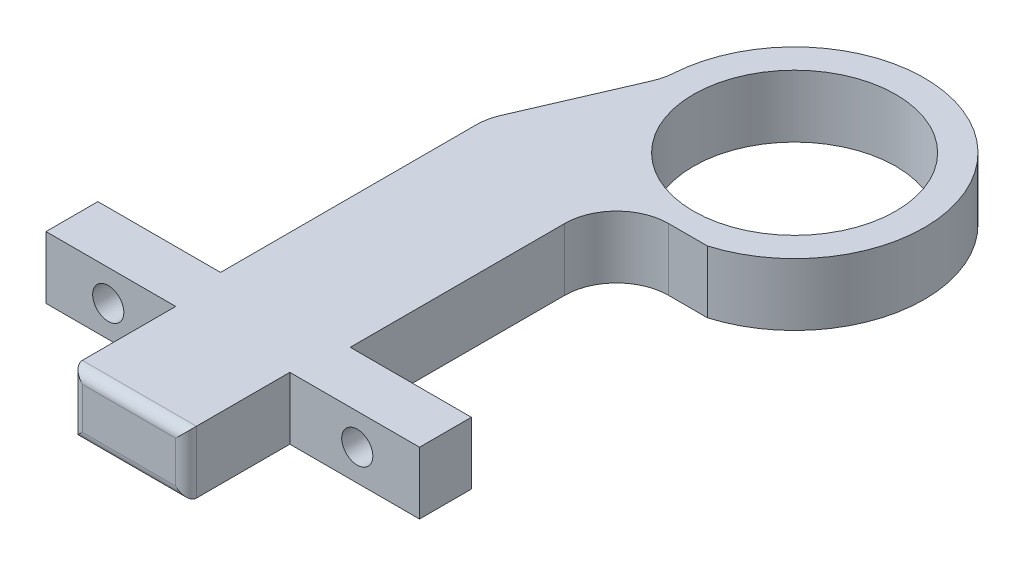
ISO-10303-21;
HEADER;
FILE_DESCRIPTION(('STEP AP214'),'2;1');
FILE_NAME('part.step','',(''),(''),'','','');
FILE_SCHEMA(('AUTOMOTIVE_DESIGN { 1 0 10303 214 1 1 1 1 }'));
ENDSEC;
DATA;
#1=APPLICATION_CONTEXT('core data for automotive mechanical design processes');
#2=APPLICATION_PROTOCOL_DEFINITION('international standard','automotive_design',2000,#1);
#3=PRODUCT_CONTEXT('',#1,'mechanical');
#4=PRODUCT('Part','Part','',(#3));
#5=PRODUCT_RELATED_PRODUCT_CATEGORY('part','',(#4));
#6=PRODUCT_DEFINITION_FORMATION('','',#4);
#7=PRODUCT_DEFINITION_CONTEXT('part definition',#1,'design');
#8=PRODUCT_DEFINITION('design','',#6,#7);
#9=PRODUCT_DEFINITION_SHAPE('','',#8);
#10=(LENGTH_UNIT() NAMED_UNIT(*) SI_UNIT(.MILLI.,.METRE.));
#11=(NAMED_UNIT(*) PLANE_ANGLE_UNIT() SI_UNIT($,.RADIAN.));
#12=(NAMED_UNIT(*) SI_UNIT($,.STERADIAN.) SOLID_ANGLE_UNIT());
#13=UNCERTAINTY_MEASURE_WITH_UNIT(LENGTH_MEASURE(1.E-05),#10,'distance_accuracy_value','');
#14=(GEOMETRIC_REPRESENTATION_CONTEXT(3) GLOBAL_UNCERTAINTY_ASSIGNED_CONTEXT((#13)) GLOBAL_UNIT_ASSIGNED_CONTEXT((#10,
#11,#12)) REPRESENTATION_CONTEXT('',''));
#15=CARTESIAN_POINT('',(0.,0.,0.));
#16=DIRECTION('',(0.,0.,1.));
#17=DIRECTION('',(1.,0.,0.));
#18=AXIS2_PLACEMENT_3D('',#15,#16,#17);
#19=CARTESIAN_POINT('',(0.,6.,16.));
#20=DIRECTION('',(0.,0.,1.));
#21=DIRECTION('',(1.,0.,0.));
#22=AXIS2_PLACEMENT_3D('',#19,#20,#21);
#23=PLANE('',#22);
#24=CARTESIAN_POINT('',(-12.,3.,16.));
#25=DIRECTION('',(0.,0.,1.));
#26=DIRECTION('',(1.,0.,0.));
#27=AXIS2_PLACEMENT_3D('',#24,#25,#26);
#28=CIRCLE('',#27,1.5);
#29=CARTESIAN_POINT('',(-10.5,3.,16.));
#30=VERTEX_POINT('',#29);
#31=EDGE_CURVE('E232',#30,#30,#28,.T.);
#32=ORIENTED_EDGE('',*,*,#31,.T.);
#33=EDGE_LOOP('',(#32));
#34=FACE_BOUND('',#33,.T.);
#35=DIRECTION('',(-1.,0.,0.));
#36=VECTOR('',#35,1.);
#37=CARTESIAN_POINT('',(0.,0.,16.));
#38=LINE('',#37,#36);
#39=CARTESIAN_POINT('',(-6.,0.,16.));
#40=VERTEX_POINT('',#39);
#41=CARTESIAN_POINT('',(-17.6776695296638,0.,16.));
#42=VERTEX_POINT('',#41);
#43=EDGE_CURVE('E192',#40,#42,#38,.T.);
#44=ORIENTED_EDGE('',*,*,#43,.T.);
#45=DIRECTION('',(0.,-1.,0.));
#46=VECTOR('',#45,1.);
#47=CARTESIAN_POINT('',(-17.6776695296638,6.,16.));
#48=LINE('',#47,#46);
#49=CARTESIAN_POINT('',(-17.6776695296638,6.,16.));
#50=VERTEX_POINT('',#49);
#51=EDGE_CURVE('E173',#50,#42,#48,.T.);
#52=ORIENTED_EDGE('',*,*,#51,.F.);
#53=DIRECTION('',(-1.,0.,0.));
#54=VECTOR('',#53,1.);
#55=CARTESIAN_POINT('',(0.,6.,16.));
#56=LINE('',#55,#54);
#57=CARTESIAN_POINT('',(-6.,6.,16.));
#58=VERTEX_POINT('',#57);
#59=EDGE_CURVE('E179',#58,#50,#56,.T.);
#60=ORIENTED_EDGE('',*,*,#59,.F.);
#61=DIRECTION('',(0.,-1.,0.));
#62=VECTOR('',#61,1.);
#63=CARTESIAN_POINT('',(-6.,6.,16.));
#64=LINE('',#63,#62);
#65=EDGE_CURVE('E270',#58,#40,#64,.T.);
#66=ORIENTED_EDGE('',*,*,#65,.T.);
#67=EDGE_LOOP('',(#44,#52,#60,#66));
#68=FACE_BOUND('',#67,.T.);
#69=ADVANCED_FACE('F35',(#34,#68),#23,.F.);
#70=CARTESIAN_POINT('',(-17.6776695296638,6.,0.));
#71=DIRECTION('',(-1.,0.,0.));
#72=DIRECTION('',(0.,0.,1.));
#73=AXIS2_PLACEMENT_3D('',#70,#71,#72);
#74=PLANE('',#73);
#75=DIRECTION('',(0.,0.,-1.));
#76=VECTOR('',#75,1.);
#77=CARTESIAN_POINT('',(-17.6776695296638,0.,0.));
#78=LINE('',#77,#76);
#79=CARTESIAN_POINT('',(-17.6776695296638,0.,-4.67169950086209));
#80=VERTEX_POINT('',#79);
#81=EDGE_CURVE('E272',#42,#80,#78,.T.);
#82=ORIENTED_EDGE('',*,*,#81,.T.);
#83=DIRECTION('',(0.,-1.,0.));
#84=VECTOR('',#83,1.);
#85=CARTESIAN_POINT('',(-17.6776695296638,6.,-4.67169950086209));
#86=LINE('',#85,#84);
#87=CARTESIAN_POINT('',(-17.6776695296638,6.,-4.67169950086209));
#88=VERTEX_POINT('',#87);
#89=EDGE_CURVE('E176',#88,#80,#86,.T.);
#90=ORIENTED_EDGE('',*,*,#89,.F.);
#91=DIRECTION('',(0.,0.,-1.));
#92=VECTOR('',#91,1.);
#93=CARTESIAN_POINT('',(-17.6776695296638,6.,0.));
#94=LINE('',#93,#92);
#95=EDGE_CURVE('E169',#50,#88,#94,.T.);
#96=ORIENTED_EDGE('',*,*,#95,.F.);
#97=ORIENTED_EDGE('',*,*,#51,.T.);
#98=EDGE_LOOP('',(#82,#90,#96,#97));
#99=FACE_BOUND('',#98,.T.);
#100=ADVANCED_FACE('F171',(#99),#74,.F.);
#101=CARTESIAN_POINT('',(-12.6776695296638,6.,-4.67169950086212));
#102=DIRECTION('',(0.,-1.,0.));
#103=DIRECTION('',(0.,0.,-1.));
#104=AXIS2_PLACEMENT_3D('',#101,#102,#103);
#105=CYLINDRICAL_SURFACE('',#104,5.);
#106=CARTESIAN_POINT('',(-12.6776695296638,0.,-4.67169950086212));
#107=DIRECTION('',(0.,1.,0.));
#108=DIRECTION('',(0.,0.,1.));
#109=AXIS2_PLACEMENT_3D('',#106,#107,#108);
#110=CIRCLE('',#109,5.);
#111=CARTESIAN_POINT('',(-12.6776695296638,0.,-9.67169950086212));
#112=VERTEX_POINT('',#111);
#113=EDGE_CURVE('E275',#80,#112,#110,.F.);
#114=ORIENTED_EDGE('',*,*,#113,.T.);
#115=DIRECTION('',(0.,-1.,0.));
#116=VECTOR('',#115,1.);
#117=CARTESIAN_POINT('',(-12.6776695296638,6.,-9.67169950086212));
#118=LINE('',#117,#116);
#119=CARTESIAN_POINT('',(-12.6776695296638,6.,-9.67169950086212));
#120=VERTEX_POINT('',#119);
#121=EDGE_CURVE('E197',#120,#112,#118,.T.);
#122=ORIENTED_EDGE('',*,*,#121,.F.);
#123=CARTESIAN_POINT('',(-12.6776695296638,6.,-4.67169950086212));
#124=DIRECTION('',(0.,1.,0.));
#125=DIRECTION('',(0.,0.,1.));
#126=AXIS2_PLACEMENT_3D('',#123,#124,#125);
#127=CIRCLE('',#126,5.);
#128=EDGE_CURVE('E178',#88,#120,#127,.F.);
#129=ORIENTED_EDGE('',*,*,#128,.F.);
#130=ORIENTED_EDGE('',*,*,#89,.T.);
#131=EDGE_LOOP('',(#114,#122,#129,#130));
#132=FACE_BOUND('',#131,.T.);
#133=ADVANCED_FACE('F343',(#132),#105,.F.);
#134=CARTESIAN_POINT('',(0.,6.,-9.67169950086212));
#135=DIRECTION('',(0.,0.,1.));
#136=DIRECTION('',(1.,0.,0.));
#137=AXIS2_PLACEMENT_3D('',#134,#135,#136);
#138=PLANE('',#137);
#139=DIRECTION('',(-1.,0.,0.));
#140=VECTOR('',#139,1.);
#141=CARTESIAN_POINT('',(0.,0.,-9.67169950086212));
#142=LINE('',#141,#140);
#143=CARTESIAN_POINT('',(-8.92857142857138,0.,-9.67169950086212));
#144=VERTEX_POINT('',#143);
#145=EDGE_CURVE('E278',#144,#112,#142,.T.);
#146=ORIENTED_EDGE('',*,*,#145,.F.);
#147=DIRECTION('',(0.,-1.,0.));
#148=VECTOR('',#147,1.);
#149=CARTESIAN_POINT('',(-8.92857142857138,6.,-9.67169950086212));
#150=LINE('',#149,#148);
#151=CARTESIAN_POINT('',(-8.92857142857138,6.,-9.67169950086212));
#152=VERTEX_POINT('',#151);
#153=EDGE_CURVE('E335',#152,#144,#150,.T.);
#154=ORIENTED_EDGE('',*,*,#153,.F.);
#155=DIRECTION('',(-1.,0.,0.));
#156=VECTOR('',#155,1.);
#157=CARTESIAN_POINT('',(0.,6.,-9.67169950086212));
#158=LINE('',#157,#156);
#159=EDGE_CURVE('E241',#152,#120,#158,.T.);
#160=ORIENTED_EDGE('',*,*,#159,.T.);
#161=ORIENTED_EDGE('',*,*,#121,.T.);
#162=EDGE_LOOP('',(#146,#154,#160,#161));
#163=FACE_BOUND('',#162,.T.);
#164=ADVANCED_FACE('F339',(#163),#138,.T.);
#165=CARTESIAN_POINT('',(-12.5,6.,-21.650635094611));
#166=DIRECTION('',(0.,-1.,0.));
#167=DIRECTION('',(0.,0.,-1.));
#168=AXIS2_PLACEMENT_3D('',#165,#166,#167);
#169=CYLINDRICAL_SURFACE('',#168,12.5);
#170=CARTESIAN_POINT('',(-12.5,0.,-21.650635094611));
#171=DIRECTION('',(0.,1.,0.));
#172=DIRECTION('',(0.,0.,1.));
#173=AXIS2_PLACEMENT_3D('',#170,#171,#172);
#174=CIRCLE('',#173,12.5);
#175=CARTESIAN_POINT('',(-24.9745166094324,0.,-22.4484040843536));
#176=VERTEX_POINT('',#175);
#177=EDGE_CURVE('E281',#144,#176,#174,.T.);
#178=ORIENTED_EDGE('',*,*,#177,.T.);
#179=DIRECTION('',(0.,-1.,0.));
#180=VECTOR('',#179,1.);
#181=CARTESIAN_POINT('',(-24.9745166094324,6.,-22.4484040843536));
#182=LINE('',#181,#180);
#183=CARTESIAN_POINT('',(-24.9745166094324,6.,-22.4484040843536));
#184=VERTEX_POINT('',#183);
#185=EDGE_CURVE('E332',#184,#176,#182,.T.);
#186=ORIENTED_EDGE('',*,*,#185,.F.);
#187=CARTESIAN_POINT('',(-12.5,6.,-21.650635094611));
#188=DIRECTION('',(0.,1.,0.));
#189=DIRECTION('',(0.,0.,1.));
#190=AXIS2_PLACEMENT_3D('',#187,#188,#189);
#191=CIRCLE('',#190,12.5);
#192=EDGE_CURVE('E244',#152,#184,#191,.T.);
#193=ORIENTED_EDGE('',*,*,#192,.F.);
#194=ORIENTED_EDGE('',*,*,#153,.T.);
#195=EDGE_LOOP('',(#178,#186,#193,#194));
#196=FACE_BOUND('',#195,.T.);
#197=ADVANCED_FACE('F351',(#196),#169,.T.);
#198=CARTESIAN_POINT('',(-29.9643232532053,6.,-22.7675116802506));
#199=DIRECTION('',(0.,-1.,0.));
#200=DIRECTION('',(0.,0.,-1.));
#201=AXIS2_PLACEMENT_3D('',#198,#199,#200);
#202=CYLINDRICAL_SURFACE('',#201,5.);
#203=CARTESIAN_POINT('',(-29.9643232532053,0.,-22.7675116802506));
#204=DIRECTION('',(0.,1.,0.));
#205=DIRECTION('',(0.,0.,1.));
#206=AXIS2_PLACEMENT_3D('',#203,#204,#205);
#207=CIRCLE('',#206,5.);
#208=CARTESIAN_POINT('',(-25.3747016471425,0.,-20.7837340936344));
#209=VERTEX_POINT('',#208);
#210=EDGE_CURVE('E283',#176,#209,#207,.F.);
#211=ORIENTED_EDGE('',*,*,#210,.T.);
#212=DIRECTION('',(0.,-1.,0.));
#213=VECTOR('',#212,1.);
#214=CARTESIAN_POINT('',(-25.3747016471425,6.,-20.7837340936344));
#215=LINE('',#214,#213);
#216=CARTESIAN_POINT('',(-25.3747016471425,6.,-20.7837340936344));
#217=VERTEX_POINT('',#216);
#218=EDGE_CURVE('E330',#217,#209,#215,.T.);
#219=ORIENTED_EDGE('',*,*,#218,.F.);
#220=CARTESIAN_POINT('',(-29.9643232532053,6.,-22.7675116802506));
#221=DIRECTION('',(0.,1.,0.));
#222=DIRECTION('',(0.,0.,1.));
#223=AXIS2_PLACEMENT_3D('',#220,#221,#222);
#224=CIRCLE('',#223,5.);
#225=EDGE_CURVE('E246',#184,#217,#224,.F.);
#226=ORIENTED_EDGE('',*,*,#225,.F.);
#227=ORIENTED_EDGE('',*,*,#185,.T.);
#228=EDGE_LOOP('',(#211,#219,#226,#227));
#229=FACE_BOUND('',#228,.T.);
#230=ADVANCED_FACE('F355',(#229),#202,.F.);
#231=CARTESIAN_POINT('',(-28.9496046006768,6.,-12.5129219089349));
#232=DIRECTION('',(-0.917924321212573,0.,-0.396755517323247));
#233=DIRECTION('',(-0.396755517323247,0.,0.917924321212573));
#234=AXIS2_PLACEMENT_3D('',#231,#232,#233);
#235=PLANE('',#234);
#236=DIRECTION('',(0.396755517323247,0.,-0.917924321212573));
#237=VECTOR('',#236,1.);
#238=CARTESIAN_POINT('',(-28.9496046006768,0.,-12.5129219089349));
#239=LINE('',#238,#237);
#240=CARTESIAN_POINT('',(-29.7672911357266,0.,-10.6211413920209));
#241=VERTEX_POINT('',#240);
#242=EDGE_CURVE('E286',#241,#209,#239,.T.);
#243=ORIENTED_EDGE('',*,*,#242,.F.);
#244=DIRECTION('',(0.,-1.,0.));
#245=VECTOR('',#244,1.);
#246=CARTESIAN_POINT('',(-29.7672911357266,6.,-10.6211413920209));
#247=LINE('',#246,#245);
#248=CARTESIAN_POINT('',(-29.7672911357266,6.,-10.6211413920209));
#249=VERTEX_POINT('',#248);
#250=EDGE_CURVE('E328',#249,#241,#247,.T.);
#251=ORIENTED_EDGE('',*,*,#250,.F.);
#252=DIRECTION('',(0.396755517323247,0.,-0.917924321212573));
#253=VECTOR('',#252,1.);
#254=CARTESIAN_POINT('',(-28.9496046006768,6.,-12.5129219089349));
#255=LINE('',#254,#253);
#256=EDGE_CURVE('E248',#249,#217,#255,.T.);
#257=ORIENTED_EDGE('',*,*,#256,.T.);
#258=ORIENTED_EDGE('',*,*,#218,.T.);
#259=EDGE_LOOP('',(#243,#251,#257,#258));
#260=FACE_BOUND('',#259,.T.);
#261=ADVANCED_FACE('F515',(#260),#235,.T.);
#262=CARTESIAN_POINT('',(-25.1776695296638,6.,-8.63736380540464));
#263=DIRECTION('',(0.,-1.,0.));
#264=DIRECTION('',(0.,0.,-1.));
#265=AXIS2_PLACEMENT_3D('',#262,#263,#264);
#266=CYLINDRICAL_SURFACE('',#265,5.);
#267=CARTESIAN_POINT('',(-25.1776695296638,0.,-8.63736380540464));
#268=DIRECTION('',(0.,1.,0.));
#269=DIRECTION('',(0.,0.,1.));
#270=AXIS2_PLACEMENT_3D('',#267,#268,#269);
#271=CIRCLE('',#270,5.);
#272=CARTESIAN_POINT('',(-30.1776695296638,0.,-8.63736380540462));
#273=VERTEX_POINT('',#272);
#274=EDGE_CURVE('E289',#273,#241,#271,.F.);
#275=ORIENTED_EDGE('',*,*,#274,.F.);
#276=DIRECTION('',(0.,-1.,0.));
#277=VECTOR('',#276,1.);
#278=CARTESIAN_POINT('',(-30.1776695296638,6.,-8.63736380540462));
#279=LINE('',#278,#277);
#280=CARTESIAN_POINT('',(-30.1776695296638,6.,-8.63736380540462));
#281=VERTEX_POINT('',#280);
#282=EDGE_CURVE('E326',#281,#273,#279,.T.);
#283=ORIENTED_EDGE('',*,*,#282,.F.);
#284=CARTESIAN_POINT('',(-25.1776695296638,6.,-8.63736380540464));
#285=DIRECTION('',(0.,1.,0.));
#286=DIRECTION('',(0.,0.,1.));
#287=AXIS2_PLACEMENT_3D('',#284,#285,#286);
#288=CIRCLE('',#287,5.);
#289=EDGE_CURVE('E251',#281,#249,#288,.F.);
#290=ORIENTED_EDGE('',*,*,#289,.T.);
#291=ORIENTED_EDGE('',*,*,#250,.T.);
#292=EDGE_LOOP('',(#275,#283,#290,#291));
#293=FACE_BOUND('',#292,.T.);
#294=ADVANCED_FACE('F363',(#293),#266,.T.);
#295=CARTESIAN_POINT('',(-30.1776695296638,6.,0.));
#296=DIRECTION('',(-1.,0.,0.));
#297=DIRECTION('',(0.,0.,1.));
#298=AXIS2_PLACEMENT_3D('',#295,#296,#297);
#299=PLANE('',#298);
#300=DIRECTION('',(0.,0.,-1.));
#301=VECTOR('',#300,1.);
#302=CARTESIAN_POINT('',(-30.1776695296638,0.,0.));
#303=LINE('',#302,#301);
#304=CARTESIAN_POINT('',(-30.1776695296638,0.,16.));
#305=VERTEX_POINT('',#304);
#306=EDGE_CURVE('E292',#305,#273,#303,.T.);
#307=ORIENTED_EDGE('',*,*,#306,.F.);
#308=DIRECTION('',(0.,-1.,0.));
#309=VECTOR('',#308,1.);
#310=CARTESIAN_POINT('',(-30.1776695296638,6.,16.));
#311=LINE('',#310,#309);
#312=CARTESIAN_POINT('',(-30.1776695296638,6.,16.));
#313=VERTEX_POINT('',#312);
#314=EDGE_CURVE('E324',#313,#305,#311,.T.);
#315=ORIENTED_EDGE('',*,*,#314,.F.);
#316=DIRECTION('',(0.,0.,-1.));
#317=VECTOR('',#316,1.);
#318=CARTESIAN_POINT('',(-30.1776695296638,6.,0.));
#319=LINE('',#318,#317);
#320=EDGE_CURVE('E254',#313,#281,#319,.T.);
#321=ORIENTED_EDGE('',*,*,#320,.T.);
#322=ORIENTED_EDGE('',*,*,#282,.T.);
#323=EDGE_LOOP('',(#307,#315,#321,#322));
#324=FACE_BOUND('',#323,.T.);
#325=ADVANCED_FACE('F367',(#324),#299,.T.);
#326=CARTESIAN_POINT('',(-36.,3.,16.));
#327=DIRECTION('',(0.,0.,1.));
#328=DIRECTION('',(1.,0.,0.));
#329=AXIS2_PLACEMENT_3D('',#326,#327,#328);
#330=CIRCLE('',#329,1.5);
#331=CARTESIAN_POINT('',(-34.5,3.,16.));
#332=VERTEX_POINT('',#331);
#333=EDGE_CURVE('E237',#332,#332,#330,.T.);
#334=ORIENTED_EDGE('',*,*,#333,.T.);
#335=EDGE_LOOP('',(#334));
#336=FACE_BOUND('',#335,.T.);
#337=CARTESIAN_POINT('',(-42.,0.,16.));
#338=VERTEX_POINT('',#337);
#339=EDGE_CURVE('E273',#305,#338,#38,.T.);
#340=ORIENTED_EDGE('',*,*,#339,.T.);
#341=DIRECTION('',(0.,-1.,0.));
#342=VECTOR('',#341,1.);
#343=CARTESIAN_POINT('',(-42.,6.,16.));
#344=LINE('',#343,#342);
#345=CARTESIAN_POINT('',(-42.,6.,16.));
#346=VERTEX_POINT('',#345);
#347=EDGE_CURVE('E321',#346,#338,#344,.T.);
#348=ORIENTED_EDGE('',*,*,#347,.F.);
#349=EDGE_CURVE('E190',#313,#346,#56,.T.);
#350=ORIENTED_EDGE('',*,*,#349,.F.);
#351=ORIENTED_EDGE('',*,*,#314,.T.);
#352=EDGE_LOOP('',(#340,#348,#350,#351));
#353=FACE_BOUND('',#352,.T.);
#354=ADVANCED_FACE('F373',(#336,#353),#23,.F.);
#355=CARTESIAN_POINT('',(-42.,6.,0.));
#356=DIRECTION('',(1.,0.,0.));
#357=DIRECTION('',(0.,0.,-1.));
#358=AXIS2_PLACEMENT_3D('',#355,#356,#357);
#359=PLANE('',#358);
#360=DIRECTION('',(0.,0.,1.));
#361=VECTOR('',#360,1.);
#362=CARTESIAN_POINT('',(-42.,0.,0.));
#363=LINE('',#362,#361);
#364=CARTESIAN_POINT('',(-42.,0.,21.));
#365=VERTEX_POINT('',#364);
#366=EDGE_CURVE('E295',#338,#365,#363,.T.);
#367=ORIENTED_EDGE('',*,*,#366,.T.);
#368=DIRECTION('',(0.,-1.,0.));
#369=VECTOR('',#368,1.);
#370=CARTESIAN_POINT('',(-42.,6.,21.));
#371=LINE('',#370,#369);
#372=CARTESIAN_POINT('',(-42.,6.,21.));
#373=VERTEX_POINT('',#372);
#374=EDGE_CURVE('E318',#373,#365,#371,.T.);
#375=ORIENTED_EDGE('',*,*,#374,.F.);
#376=DIRECTION('',(0.,0.,1.));
#377=VECTOR('',#376,1.);
#378=CARTESIAN_POINT('',(-42.,6.,0.));
#379=LINE('',#378,#377);
#380=EDGE_CURVE('E257',#346,#373,#379,.T.);
#381=ORIENTED_EDGE('',*,*,#380,.F.);
#382=ORIENTED_EDGE('',*,*,#347,.T.);
#383=EDGE_LOOP('',(#367,#375,#381,#382));
#384=FACE_BOUND('',#383,.T.);
#385=ADVANCED_FACE('F377',(#384),#359,.F.);
#386=CARTESIAN_POINT('',(0.,6.,21.));
#387=DIRECTION('',(0.,0.,-1.));
#388=DIRECTION('',(-1.,0.,0.));
#389=AXIS2_PLACEMENT_3D('',#386,#387,#388);
#390=PLANE('',#389);
#391=CARTESIAN_POINT('',(-36.,3.,21.));
#392=DIRECTION('',(0.,0.,1.));
#393=DIRECTION('',(1.,0.,0.));
#394=AXIS2_PLACEMENT_3D('',#391,#392,#393);
#395=CIRCLE('',#394,1.5);
#396=CARTESIAN_POINT('',(-34.5,3.,21.));
#397=VERTEX_POINT('',#396);
#398=EDGE_CURVE('E227',#397,#397,#395,.T.);
#399=ORIENTED_EDGE('',*,*,#398,.F.);
#400=EDGE_LOOP('',(#399));
#401=FACE_BOUND('',#400,.T.);
#402=DIRECTION('',(1.,0.,0.));
#403=VECTOR('',#402,1.);
#404=CARTESIAN_POINT('',(0.,0.,21.));
#405=LINE('',#404,#403);
#406=CARTESIAN_POINT('',(-29.5,0.,21.));
#407=VERTEX_POINT('',#406);
#408=EDGE_CURVE('E297',#365,#407,#405,.T.);
#409=ORIENTED_EDGE('',*,*,#408,.T.);
#410=DIRECTION('',(0.,-1.,0.));
#411=VECTOR('',#410,1.);
#412=CARTESIAN_POINT('',(-29.5,6.,21.));
#413=LINE('',#412,#411);
#414=CARTESIAN_POINT('',(-29.5,6.,21.));
#415=VERTEX_POINT('',#414);
#416=EDGE_CURVE('E315',#415,#407,#413,.T.);
#417=ORIENTED_EDGE('',*,*,#416,.F.);
#418=DIRECTION('',(1.,0.,0.));
#419=VECTOR('',#418,1.);
#420=CARTESIAN_POINT('',(0.,6.,21.));
#421=LINE('',#420,#419);
#422=EDGE_CURVE('E259',#373,#415,#421,.T.);
#423=ORIENTED_EDGE('',*,*,#422,.F.);
#424=ORIENTED_EDGE('',*,*,#374,.T.);
#425=EDGE_LOOP('',(#409,#417,#423,#424));
#426=FACE_BOUND('',#425,.T.);
#427=ADVANCED_FACE('F382',(#401,#426),#390,.F.);
#428=CARTESIAN_POINT('',(-29.5,6.,0.));
#429=DIRECTION('',(1.,0.,0.));
#430=DIRECTION('',(0.,0.,-1.));
#431=AXIS2_PLACEMENT_3D('',#428,#429,#430);
#432=PLANE('',#431);
#433=DIRECTION('',(0.,0.,1.));
#434=VECTOR('',#433,1.);
#435=CARTESIAN_POINT('',(-29.5,0.,0.));
#436=LINE('',#435,#434);
#437=CARTESIAN_POINT('',(-29.5,0.,30.));
#438=VERTEX_POINT('',#437);
#439=EDGE_CURVE('E299',#407,#438,#436,.T.);
#440=ORIENTED_EDGE('',*,*,#439,.T.);
#441=DIRECTION('',(0.,-1.,0.));
#442=VECTOR('',#441,1.);
#443=CARTESIAN_POINT('',(-29.5,6.,30.));
#444=LINE('',#443,#442);
#445=CARTESIAN_POINT('',(-29.5,6.,30.));
#446=VERTEX_POINT('',#445);
#447=EDGE_CURVE('E207',#438,#446,#444,.F.);
#448=ORIENTED_EDGE('',*,*,#447,.T.);
#449=DIRECTION('',(0.,0.,1.));
#450=VECTOR('',#449,1.);
#451=CARTESIAN_POINT('',(-29.5,6.,0.));
#452=LINE('',#451,#450);
#453=EDGE_CURVE('E261',#415,#446,#452,.T.);
#454=ORIENTED_EDGE('',*,*,#453,.F.);
#455=ORIENTED_EDGE('',*,*,#416,.T.);
#456=EDGE_LOOP('',(#440,#448,#454,#455));
#457=FACE_BOUND('',#456,.T.);
#458=ADVANCED_FACE('F385',(#457),#432,.F.);
#459=CARTESIAN_POINT('',(0.,6.,31.));
#460=DIRECTION('',(0.,0.,-1.));
#461=DIRECTION('',(-1.,0.,0.));
#462=AXIS2_PLACEMENT_3D('',#459,#460,#461);
#463=PLANE('',#462);
#464=DIRECTION('',(1.,0.,0.));
#465=VECTOR('',#464,1.);
#466=CARTESIAN_POINT('',(-29.5,5.,31.));
#467=LINE('',#466,#465);
#468=CARTESIAN_POINT('',(-19.5,5.,31.));
#469=VERTEX_POINT('',#468);
#470=CARTESIAN_POINT('',(-28.5,5.,31.));
#471=VERTEX_POINT('',#470);
#472=EDGE_CURVE('E202',#469,#471,#467,.F.);
#473=ORIENTED_EDGE('',*,*,#472,.T.);
#474=DIRECTION('',(0.,-1.,0.));
#475=VECTOR('',#474,1.);
#476=CARTESIAN_POINT('',(-28.5,6.,31.));
#477=LINE('',#476,#475);
#478=CARTESIAN_POINT('',(-28.5,1.,31.));
#479=VERTEX_POINT('',#478);
#480=EDGE_CURVE('E204',#471,#479,#477,.T.);
#481=ORIENTED_EDGE('',*,*,#480,.T.);
#482=DIRECTION('',(1.,0.,0.));
#483=VECTOR('',#482,1.);
#484=CARTESIAN_POINT('',(0.,1.,31.));
#485=LINE('',#484,#483);
#486=CARTESIAN_POINT('',(-19.5,1.,31.));
#487=VERTEX_POINT('',#486);
#488=EDGE_CURVE('E193',#479,#487,#485,.T.);
#489=ORIENTED_EDGE('',*,*,#488,.T.);
#490=DIRECTION('',(0.,-1.,0.));
#491=VECTOR('',#490,1.);
#492=CARTESIAN_POINT('',(-19.5,6.,31.));
#493=LINE('',#492,#491);
#494=EDGE_CURVE('E195',#487,#469,#493,.F.);
#495=ORIENTED_EDGE('',*,*,#494,.T.);
#496=EDGE_LOOP('',(#473,#481,#489,#495));
#497=FACE_BOUND('',#496,.T.);
#498=ADVANCED_FACE('F396',(#497),#463,.F.);
#499=CARTESIAN_POINT('',(-18.5,6.,0.));
#500=DIRECTION('',(1.,0.,0.));
#501=DIRECTION('',(0.,0.,-1.));
#502=AXIS2_PLACEMENT_3D('',#499,#500,#501);
#503=PLANE('',#502);
#504=DIRECTION('',(0.,0.,1.));
#505=VECTOR('',#504,1.);
#506=CARTESIAN_POINT('',(-18.5,6.,0.));
#507=LINE('',#506,#505);
#508=CARTESIAN_POINT('',(-18.5,6.,21.));
#509=VERTEX_POINT('',#508);
#510=CARTESIAN_POINT('',(-18.5,6.,30.));
#511=VERTEX_POINT('',#510);
#512=EDGE_CURVE('E264',#509,#511,#507,.T.);
#513=ORIENTED_EDGE('',*,*,#512,.T.);
#514=DIRECTION('',(0.,-1.,0.));
#515=VECTOR('',#514,1.);
#516=CARTESIAN_POINT('',(-18.5,0.,30.));
#517=LINE('',#516,#515);
#518=CARTESIAN_POINT('',(-18.5,0.,30.));
#519=VERTEX_POINT('',#518);
#520=EDGE_CURVE('E44',#511,#519,#517,.T.);
#521=ORIENTED_EDGE('',*,*,#520,.T.);
#522=DIRECTION('',(0.,0.,1.));
#523=VECTOR('',#522,1.);
#524=CARTESIAN_POINT('',(-18.5,0.,0.));
#525=LINE('',#524,#523);
#526=CARTESIAN_POINT('',(-18.5,0.,21.));
#527=VERTEX_POINT('',#526);
#528=EDGE_CURVE('E303',#527,#519,#525,.T.);
#529=ORIENTED_EDGE('',*,*,#528,.F.);
#530=DIRECTION('',(0.,-1.,0.));
#531=VECTOR('',#530,1.);
#532=CARTESIAN_POINT('',(-18.5,6.,21.));
#533=LINE('',#532,#531);
#534=EDGE_CURVE('E313',#509,#527,#533,.T.);
#535=ORIENTED_EDGE('',*,*,#534,.F.);
#536=EDGE_LOOP('',(#513,#521,#529,#535));
#537=FACE_BOUND('',#536,.T.);
#538=ADVANCED_FACE('F447',(#537),#503,.T.);
#539=CARTESIAN_POINT('',(-12.,3.,21.));
#540=DIRECTION('',(0.,0.,1.));
#541=DIRECTION('',(1.,0.,0.));
#542=AXIS2_PLACEMENT_3D('',#539,#540,#541);
#543=CIRCLE('',#542,1.5);
#544=CARTESIAN_POINT('',(-10.5,3.,21.));
#545=VERTEX_POINT('',#544);
#546=EDGE_CURVE('E222',#545,#545,#543,.T.);
#547=ORIENTED_EDGE('',*,*,#546,.F.);
#548=EDGE_LOOP('',(#547));
#549=FACE_BOUND('',#548,.T.);
#550=CARTESIAN_POINT('',(-6.,0.,21.));
#551=VERTEX_POINT('',#550);
#552=EDGE_CURVE('E300',#527,#551,#405,.T.);
#553=ORIENTED_EDGE('',*,*,#552,.T.);
#554=DIRECTION('',(0.,-1.,0.));
#555=VECTOR('',#554,1.);
#556=CARTESIAN_POINT('',(-6.,6.,21.));
#557=LINE('',#556,#555);
#558=CARTESIAN_POINT('',(-6.,6.,21.));
#559=VERTEX_POINT('',#558);
#560=EDGE_CURVE('E311',#559,#551,#557,.T.);
#561=ORIENTED_EDGE('',*,*,#560,.F.);
#562=EDGE_CURVE('E262',#509,#559,#421,.T.);
#563=ORIENTED_EDGE('',*,*,#562,.F.);
#564=ORIENTED_EDGE('',*,*,#534,.T.);
#565=EDGE_LOOP('',(#553,#561,#563,#564));
#566=FACE_BOUND('',#565,.T.);
#567=ADVANCED_FACE('F443',(#549,#566),#390,.F.);
#568=CARTESIAN_POINT('',(-6.,6.,0.));
#569=DIRECTION('',(1.,0.,0.));
#570=DIRECTION('',(0.,0.,-1.));
#571=AXIS2_PLACEMENT_3D('',#568,#569,#570);
#572=PLANE('',#571);
#573=DIRECTION('',(0.,0.,1.));
#574=VECTOR('',#573,1.);
#575=CARTESIAN_POINT('',(-6.,0.,0.));
#576=LINE('',#575,#574);
#577=EDGE_CURVE('E305',#40,#551,#576,.T.);
#578=ORIENTED_EDGE('',*,*,#577,.F.);
#579=ORIENTED_EDGE('',*,*,#65,.F.);
#580=DIRECTION('',(0.,0.,1.));
#581=VECTOR('',#580,1.);
#582=CARTESIAN_POINT('',(-6.,6.,0.));
#583=LINE('',#582,#581);
#584=EDGE_CURVE('E186',#58,#559,#583,.T.);
#585=ORIENTED_EDGE('',*,*,#584,.T.);
#586=ORIENTED_EDGE('',*,*,#560,.T.);
#587=EDGE_LOOP('',(#578,#579,#585,#586));
#588=FACE_BOUND('',#587,.T.);
#589=ADVANCED_FACE('F439',(#588),#572,.T.);
#590=CARTESIAN_POINT('',(-12.5,6.,-21.650635094611));
#591=DIRECTION('',(0.,-1.,0.));
#592=DIRECTION('',(0.,0.,-1.));
#593=AXIS2_PLACEMENT_3D('',#590,#591,#592);
#594=CYLINDRICAL_SURFACE('',#593,9.75);
#595=CARTESIAN_POINT('',(-12.5,6.,-21.650635094611));
#596=DIRECTION('',(0.,1.,0.));
#597=DIRECTION('',(0.,0.,1.));
#598=AXIS2_PLACEMENT_3D('',#595,#596,#597);
#599=CIRCLE('',#598,9.75);
#600=CARTESIAN_POINT('',(-12.5,6.,-11.900635094611));
#601=VERTEX_POINT('',#600);
#602=EDGE_CURVE('E267',#601,#601,#599,.T.);
#603=ORIENTED_EDGE('',*,*,#602,.T.);
#604=EDGE_LOOP('',(#603));
#605=FACE_BOUND('',#604,.T.);
#606=CARTESIAN_POINT('',(-12.5,0.,-21.650635094611));
#607=DIRECTION('',(0.,1.,0.));
#608=DIRECTION('',(0.,0.,1.));
#609=AXIS2_PLACEMENT_3D('',#606,#607,#608);
#610=CIRCLE('',#609,9.75);
#611=CARTESIAN_POINT('',(-12.5,0.,-11.900635094611));
#612=VERTEX_POINT('',#611);
#613=EDGE_CURVE('E188',#612,#612,#610,.T.);
#614=ORIENTED_EDGE('',*,*,#613,.F.);
#615=EDGE_LOOP('',(#614));
#616=FACE_BOUND('',#615,.T.);
#617=ADVANCED_FACE('F434',(#605,#616),#594,.F.);
#618=CARTESIAN_POINT('',(0.,6.,0.));
#619=DIRECTION('',(0.,1.,0.));
#620=DIRECTION('',(0.,0.,1.));
#621=AXIS2_PLACEMENT_3D('',#618,#619,#620);
#622=PLANE('',#621);
#623=ORIENTED_EDGE('',*,*,#453,.T.);
#624=DIRECTION('',(1.,0.,0.));
#625=VECTOR('',#624,1.);
#626=CARTESIAN_POINT('',(-18.5,6.,30.));
#627=LINE('',#626,#625);
#628=EDGE_CURVE('E59',#446,#511,#627,.T.);
#629=ORIENTED_EDGE('',*,*,#628,.T.);
#630=ORIENTED_EDGE('',*,*,#512,.F.);
#631=ORIENTED_EDGE('',*,*,#562,.T.);
#632=ORIENTED_EDGE('',*,*,#584,.F.);
#633=ORIENTED_EDGE('',*,*,#59,.T.);
#634=ORIENTED_EDGE('',*,*,#95,.T.);
#635=ORIENTED_EDGE('',*,*,#128,.T.);
#636=ORIENTED_EDGE('',*,*,#159,.F.);
#637=ORIENTED_EDGE('',*,*,#192,.T.);
#638=ORIENTED_EDGE('',*,*,#225,.T.);
#639=ORIENTED_EDGE('',*,*,#256,.F.);
#640=ORIENTED_EDGE('',*,*,#289,.F.);
#641=ORIENTED_EDGE('',*,*,#320,.F.);
#642=ORIENTED_EDGE('',*,*,#349,.T.);
#643=ORIENTED_EDGE('',*,*,#380,.T.);
#644=ORIENTED_EDGE('',*,*,#422,.T.);
#645=EDGE_LOOP('',(#623,#629,#630,#631,#632,#633,#634,#635,#636,#637,#638,#639,#640,#641,#642,
#643,#644));
#646=FACE_BOUND('',#645,.T.);
#647=ORIENTED_EDGE('',*,*,#602,.F.);
#648=EDGE_LOOP('',(#647));
#649=FACE_BOUND('',#648,.T.);
#650=ADVANCED_FACE('F183',(#646,#649),#622,.T.);
#651=CARTESIAN_POINT('',(0.,0.,0.));
#652=DIRECTION('',(0.,1.,0.));
#653=DIRECTION('',(0.,0.,1.));
#654=AXIS2_PLACEMENT_3D('',#651,#652,#653);
#655=PLANE('',#654);
#656=ORIENTED_EDGE('',*,*,#528,.T.);
#657=DIRECTION('',(1.,0.,0.));
#658=VECTOR('',#657,1.);
#659=CARTESIAN_POINT('',(0.,0.,30.));
#660=LINE('',#659,#658);
#661=EDGE_CURVE('E11',#519,#438,#660,.F.);
#662=ORIENTED_EDGE('',*,*,#661,.T.);
#663=ORIENTED_EDGE('',*,*,#439,.F.);
#664=ORIENTED_EDGE('',*,*,#408,.F.);
#665=ORIENTED_EDGE('',*,*,#366,.F.);
#666=ORIENTED_EDGE('',*,*,#339,.F.);
#667=ORIENTED_EDGE('',*,*,#306,.T.);
#668=ORIENTED_EDGE('',*,*,#274,.T.);
#669=ORIENTED_EDGE('',*,*,#242,.T.);
#670=ORIENTED_EDGE('',*,*,#210,.F.);
#671=ORIENTED_EDGE('',*,*,#177,.F.);
#672=ORIENTED_EDGE('',*,*,#145,.T.);
#673=ORIENTED_EDGE('',*,*,#113,.F.);
#674=ORIENTED_EDGE('',*,*,#81,.F.);
#675=ORIENTED_EDGE('',*,*,#43,.F.);
#676=ORIENTED_EDGE('',*,*,#577,.T.);
#677=ORIENTED_EDGE('',*,*,#552,.F.);
#678=EDGE_LOOP('',(#656,#662,#663,#664,#665,#666,#667,#668,#669,#670,#671,#672,#673,#674,#675,
#676,#677));
#679=FACE_BOUND('',#678,.T.);
#680=ORIENTED_EDGE('',*,*,#613,.T.);
#681=EDGE_LOOP('',(#680));
#682=FACE_BOUND('',#681,.T.);
#683=ADVANCED_FACE('F346',(#679,#682),#655,.F.);
#684=CARTESIAN_POINT('',(-12.,3.,15.));
#685=DIRECTION('',(0.,0.,1.));
#686=DIRECTION('',(1.,0.,0.));
#687=AXIS2_PLACEMENT_3D('',#684,#685,#686);
#688=CYLINDRICAL_SURFACE('',#687,1.5);
#689=ORIENTED_EDGE('',*,*,#546,.T.);
#690=EDGE_LOOP('',(#689));
#691=FACE_BOUND('',#690,.T.);
#692=ORIENTED_EDGE('',*,*,#31,.F.);
#693=EDGE_LOOP('',(#692));
#694=FACE_BOUND('',#693,.T.);
#695=ADVANCED_FACE('F424',(#691,#694),#688,.F.);
#696=CARTESIAN_POINT('',(-36.,3.,15.));
#697=DIRECTION('',(0.,0.,1.));
#698=DIRECTION('',(1.,0.,0.));
#699=AXIS2_PLACEMENT_3D('',#696,#697,#698);
#700=CYLINDRICAL_SURFACE('',#699,1.5);
#701=ORIENTED_EDGE('',*,*,#398,.T.);
#702=EDGE_LOOP('',(#701));
#703=FACE_BOUND('',#702,.T.);
#704=ORIENTED_EDGE('',*,*,#333,.F.);
#705=EDGE_LOOP('',(#704));
#706=FACE_BOUND('',#705,.T.);
#707=ADVANCED_FACE('F404',(#703,#706),#700,.F.);
#708=CARTESIAN_POINT('',(-19.5,6.,30.));
#709=DIRECTION('',(0.,1.,0.));
#710=DIRECTION('',(0.,0.,1.));
#711=AXIS2_PLACEMENT_3D('',#708,#709,#710);
#712=CYLINDRICAL_SURFACE('',#711,1.);
#713=CARTESIAN_POINT('',(-19.5,1.,30.));
#714=DIRECTION('',(0.707106781186547,0.707106781186547,0.));
#715=DIRECTION('',(0.707106781186547,-0.707106781186547,0.));
#716=AXIS2_PLACEMENT_3D('',#713,#714,#715);
#717=ELLIPSE('',#716,1.41421356237309,1.);
#718=EDGE_CURVE('E215',#519,#487,#717,.F.);
#719=ORIENTED_EDGE('',*,*,#718,.F.);
#720=ORIENTED_EDGE('',*,*,#520,.F.);
#721=CARTESIAN_POINT('',(-19.5,5.,30.));
#722=DIRECTION('',(-0.707106781186547,0.707106781186547,0.));
#723=DIRECTION('',(0.707106781186547,0.707106781186547,0.));
#724=AXIS2_PLACEMENT_3D('',#721,#722,#723);
#725=ELLIPSE('',#724,1.41421356237309,1.);
#726=EDGE_CURVE('E39',#469,#511,#725,.T.);
#727=ORIENTED_EDGE('',*,*,#726,.F.);
#728=ORIENTED_EDGE('',*,*,#494,.F.);
#729=EDGE_LOOP('',(#719,#720,#727,#728));
#730=FACE_BOUND('',#729,.T.);
#731=ADVANCED_FACE('F37',(#730),#712,.T.);
#732=CARTESIAN_POINT('',(0.,5.,30.));
#733=DIRECTION('',(-1.,0.,0.));
#734=DIRECTION('',(0.,0.,1.));
#735=AXIS2_PLACEMENT_3D('',#732,#733,#734);
#736=CYLINDRICAL_SURFACE('',#735,1.);
#737=ORIENTED_EDGE('',*,*,#726,.T.);
#738=ORIENTED_EDGE('',*,*,#628,.F.);
#739=CARTESIAN_POINT('',(-28.5,5.,30.));
#740=DIRECTION('',(-0.707106781186547,-0.707106781186547,0.));
#741=DIRECTION('',(-0.707106781186547,0.707106781186547,0.));
#742=AXIS2_PLACEMENT_3D('',#739,#740,#741);
#743=ELLIPSE('',#742,1.41421356237309,1.);
#744=EDGE_CURVE('E214',#471,#446,#743,.T.);
#745=ORIENTED_EDGE('',*,*,#744,.F.);
#746=ORIENTED_EDGE('',*,*,#472,.F.);
#747=EDGE_LOOP('',(#737,#738,#745,#746));
#748=FACE_BOUND('',#747,.T.);
#749=ADVANCED_FACE('F397',(#748),#736,.T.);
#750=CARTESIAN_POINT('',(0.,1.,30.));
#751=DIRECTION('',(1.,0.,0.));
#752=DIRECTION('',(0.,0.,-1.));
#753=AXIS2_PLACEMENT_3D('',#750,#751,#752);
#754=CYLINDRICAL_SURFACE('',#753,1.);
#755=ORIENTED_EDGE('',*,*,#718,.T.);
#756=ORIENTED_EDGE('',*,*,#488,.F.);
#757=CARTESIAN_POINT('',(-28.5,1.,30.));
#758=DIRECTION('',(0.707106781186547,-0.707106781186547,0.));
#759=DIRECTION('',(0.707106781186547,0.707106781186547,0.));
#760=AXIS2_PLACEMENT_3D('',#757,#758,#759);
#761=ELLIPSE('',#760,1.41421356237309,1.);
#762=EDGE_CURVE('E212',#438,#479,#761,.F.);
#763=ORIENTED_EDGE('',*,*,#762,.F.);
#764=ORIENTED_EDGE('',*,*,#661,.F.);
#765=EDGE_LOOP('',(#755,#756,#763,#764));
#766=FACE_BOUND('',#765,.T.);
#767=ADVANCED_FACE('F393',(#766),#754,.T.);
#768=CARTESIAN_POINT('',(-28.5,6.,30.));
#769=DIRECTION('',(0.,-1.,0.));
#770=DIRECTION('',(0.,0.,-1.));
#771=AXIS2_PLACEMENT_3D('',#768,#769,#770);
#772=CYLINDRICAL_SURFACE('',#771,1.);
#773=ORIENTED_EDGE('',*,*,#744,.T.);
#774=ORIENTED_EDGE('',*,*,#447,.F.);
#775=ORIENTED_EDGE('',*,*,#762,.T.);
#776=ORIENTED_EDGE('',*,*,#480,.F.);
#777=EDGE_LOOP('',(#773,#774,#775,#776));
#778=FACE_BOUND('',#777,.T.);
#779=ADVANCED_FACE('F390',(#778),#772,.T.);
#780=CLOSED_SHELL('',(#69,#100,#133,#164,#197,#230,#261,#294,#325,#354,#385,#427,#458,#498,#538,
#567,#589,#617,#650,#683,#695,#707,#731,#749,#767,#779));
#781=MANIFOLD_SOLID_BREP('B2',#780);
#782=ADVANCED_BREP_SHAPE_REPRESENTATION('',(#18,#781),#14);
#783=SHAPE_DEFINITION_REPRESENTATION(#9,#782);
ENDSEC;
END-ISO-10303-21;
